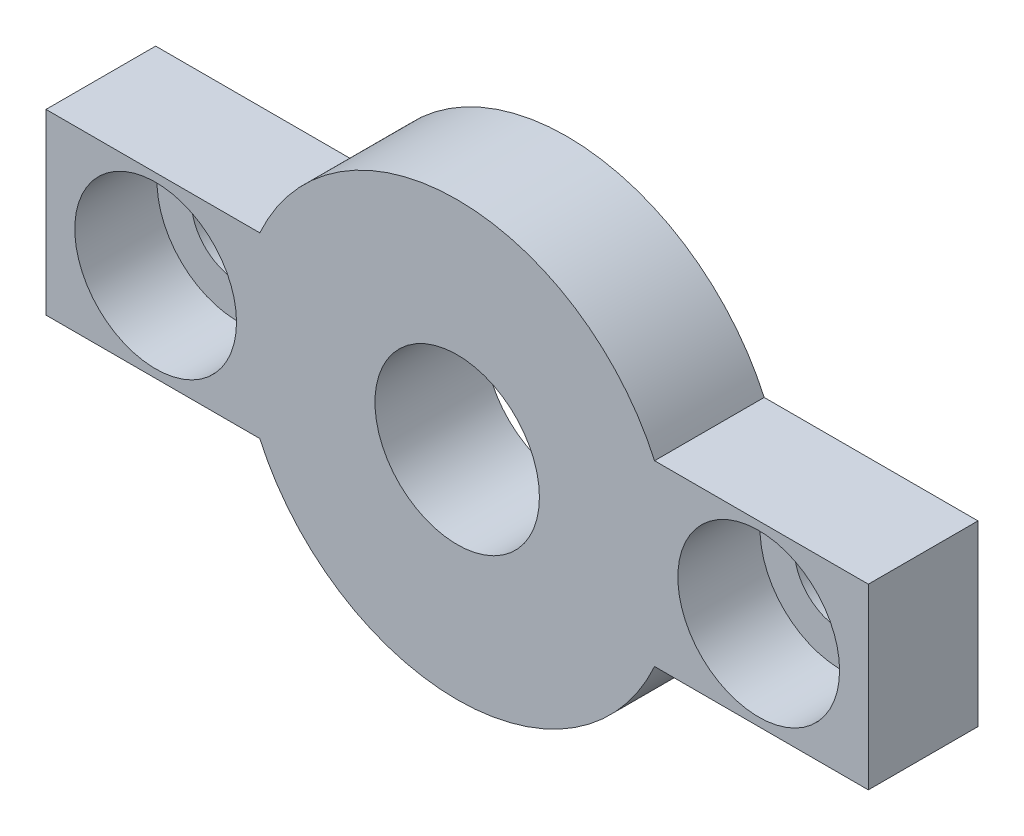
ISO-10303-21;
HEADER;
FILE_DESCRIPTION(('STEP AP214'),'2;1');
FILE_NAME('part.step','',(''),(''),'','','');
FILE_SCHEMA(('AUTOMOTIVE_DESIGN { 1 0 10303 214 1 1 1 1 }'));
ENDSEC;
DATA;
#1=APPLICATION_CONTEXT('core data for automotive mechanical design processes');
#2=APPLICATION_PROTOCOL_DEFINITION('international standard','automotive_design',2000,#1);
#3=PRODUCT_CONTEXT('',#1,'mechanical');
#4=PRODUCT('Part','Part','',(#3));
#5=PRODUCT_RELATED_PRODUCT_CATEGORY('part','',(#4));
#6=PRODUCT_DEFINITION_FORMATION('','',#4);
#7=PRODUCT_DEFINITION_CONTEXT('part definition',#1,'design');
#8=PRODUCT_DEFINITION('design','',#6,#7);
#9=PRODUCT_DEFINITION_SHAPE('','',#8);
#10=(LENGTH_UNIT() NAMED_UNIT(*) SI_UNIT(.MILLI.,.METRE.));
#11=(NAMED_UNIT(*) PLANE_ANGLE_UNIT() SI_UNIT($,.RADIAN.));
#12=(NAMED_UNIT(*) SI_UNIT($,.STERADIAN.) SOLID_ANGLE_UNIT());
#13=UNCERTAINTY_MEASURE_WITH_UNIT(LENGTH_MEASURE(1.E-05),#10,'distance_accuracy_value','');
#14=(GEOMETRIC_REPRESENTATION_CONTEXT(3) GLOBAL_UNCERTAINTY_ASSIGNED_CONTEXT((#13)) GLOBAL_UNIT_ASSIGNED_CONTEXT((#10,
#11,#12)) REPRESENTATION_CONTEXT('',''));
#15=CARTESIAN_POINT('',(0.,0.,0.));
#16=DIRECTION('',(0.,0.,1.));
#17=DIRECTION('',(1.,0.,0.));
#18=AXIS2_PLACEMENT_3D('',#15,#16,#17);
#19=CARTESIAN_POINT('',(11.,0.,0.));
#20=DIRECTION('',(0.,0.,1.));
#21=DIRECTION('',(1.,0.,0.));
#22=AXIS2_PLACEMENT_3D('',#19,#20,#21);
#23=CYLINDRICAL_SURFACE('',#22,1.7);
#24=CARTESIAN_POINT('',(11.,0.,0.));
#25=DIRECTION('',(0.,0.,1.));
#26=DIRECTION('',(1.,0.,0.));
#27=AXIS2_PLACEMENT_3D('',#24,#25,#26);
#28=CIRCLE('',#27,1.7);
#29=CARTESIAN_POINT('',(12.7,0.,0.));
#30=VERTEX_POINT('',#29);
#31=EDGE_CURVE('E193',#30,#30,#28,.T.);
#32=ORIENTED_EDGE('',*,*,#31,.F.);
#33=EDGE_LOOP('',(#32));
#34=FACE_BOUND('',#33,.T.);
#35=CARTESIAN_POINT('',(11.,0.,1.));
#36=DIRECTION('',(0.,0.,1.));
#37=DIRECTION('',(1.,0.,0.));
#38=AXIS2_PLACEMENT_3D('',#35,#36,#37);
#39=CIRCLE('',#38,1.7);
#40=CARTESIAN_POINT('',(12.7,0.,1.));
#41=VERTEX_POINT('',#40);
#42=EDGE_CURVE('E43',#41,#41,#39,.F.);
#43=ORIENTED_EDGE('',*,*,#42,.F.);
#44=EDGE_LOOP('',(#43));
#45=FACE_BOUND('',#44,.T.);
#46=ADVANCED_FACE('F39',(#34,#45),#23,.F.);
#47=CARTESIAN_POINT('',(-11.,0.,0.));
#48=DIRECTION('',(0.,0.,1.));
#49=DIRECTION('',(1.,0.,0.));
#50=AXIS2_PLACEMENT_3D('',#47,#48,#49);
#51=CYLINDRICAL_SURFACE('',#50,1.7);
#52=CARTESIAN_POINT('',(-11.,0.,0.));
#53=DIRECTION('',(0.,0.,1.));
#54=DIRECTION('',(1.,0.,0.));
#55=AXIS2_PLACEMENT_3D('',#52,#53,#54);
#56=CIRCLE('',#55,1.7);
#57=CARTESIAN_POINT('',(-9.3,0.,0.));
#58=VERTEX_POINT('',#57);
#59=EDGE_CURVE('E211',#58,#58,#56,.T.);
#60=ORIENTED_EDGE('',*,*,#59,.F.);
#61=EDGE_LOOP('',(#60));
#62=FACE_BOUND('',#61,.T.);
#63=CARTESIAN_POINT('',(-11.,0.,1.));
#64=DIRECTION('',(0.,0.,1.));
#65=DIRECTION('',(1.,0.,0.));
#66=AXIS2_PLACEMENT_3D('',#63,#64,#65);
#67=CIRCLE('',#66,1.7);
#68=CARTESIAN_POINT('',(-9.3,0.,1.));
#69=VERTEX_POINT('',#68);
#70=EDGE_CURVE('E184',#69,#69,#67,.F.);
#71=ORIENTED_EDGE('',*,*,#70,.F.);
#72=EDGE_LOOP('',(#71));
#73=FACE_BOUND('',#72,.T.);
#74=ADVANCED_FACE('F267',(#62,#73),#51,.F.);
#75=CARTESIAN_POINT('',(0.,0.,4.));
#76=DIRECTION('',(0.,0.,1.));
#77=DIRECTION('',(1.,0.,0.));
#78=AXIS2_PLACEMENT_3D('',#75,#76,#77);
#79=PLANE('',#78);
#80=CARTESIAN_POINT('',(-11.,0.,4.));
#81=DIRECTION('',(0.,0.,1.));
#82=DIRECTION('',(1.,0.,0.));
#83=AXIS2_PLACEMENT_3D('',#80,#81,#82);
#84=CIRCLE('',#83,2.95);
#85=CARTESIAN_POINT('',(-8.05,0.,4.));
#86=VERTEX_POINT('',#85);
#87=EDGE_CURVE('E195',#86,#86,#84,.T.);
#88=ORIENTED_EDGE('',*,*,#87,.F.);
#89=EDGE_LOOP('',(#88));
#90=FACE_BOUND('',#89,.T.);
#91=CARTESIAN_POINT('',(11.,0.,4.));
#92=DIRECTION('',(0.,0.,1.));
#93=DIRECTION('',(1.,0.,0.));
#94=AXIS2_PLACEMENT_3D('',#91,#92,#93);
#95=CIRCLE('',#94,2.95);
#96=CARTESIAN_POINT('',(13.95,0.,4.));
#97=VERTEX_POINT('',#96);
#98=EDGE_CURVE('E207',#97,#97,#95,.T.);
#99=ORIENTED_EDGE('',*,*,#98,.F.);
#100=EDGE_LOOP('',(#99));
#101=FACE_BOUND('',#100,.T.);
#102=DIRECTION('',(0.,-1.,0.));
#103=VECTOR('',#102,1.);
#104=CARTESIAN_POINT('',(-15.,-3.25,4.));
#105=LINE('',#104,#103);
#106=CARTESIAN_POINT('',(-15.,3.25,4.));
#107=VERTEX_POINT('',#106);
#108=CARTESIAN_POINT('',(-15.,-3.25,4.));
#109=VERTEX_POINT('',#108);
#110=EDGE_CURVE('E167',#107,#109,#105,.T.);
#111=ORIENTED_EDGE('',*,*,#110,.T.);
#112=DIRECTION('',(1.,0.,0.));
#113=VECTOR('',#112,1.);
#114=CARTESIAN_POINT('',(-7.20052081449669,-3.25,4.));
#115=LINE('',#114,#113);
#116=CARTESIAN_POINT('',(-7.20052081449669,-3.25,4.));
#117=VERTEX_POINT('',#116);
#118=EDGE_CURVE('E102',#109,#117,#115,.T.);
#119=ORIENTED_EDGE('',*,*,#118,.T.);
#120=CARTESIAN_POINT('',(0.,0.,4.));
#121=DIRECTION('',(0.,0.,1.));
#122=DIRECTION('',(1.,0.,0.));
#123=AXIS2_PLACEMENT_3D('',#120,#121,#122);
#124=CIRCLE('',#123,7.9);
#125=CARTESIAN_POINT('',(7.20052081449669,-3.25,4.));
#126=VERTEX_POINT('',#125);
#127=EDGE_CURVE('E229',#117,#126,#124,.T.);
#128=ORIENTED_EDGE('',*,*,#127,.T.);
#129=DIRECTION('',(1.,0.,0.));
#130=VECTOR('',#129,1.);
#131=CARTESIAN_POINT('',(15.,-3.25,4.));
#132=LINE('',#131,#130);
#133=CARTESIAN_POINT('',(15.,-3.25,4.));
#134=VERTEX_POINT('',#133);
#135=EDGE_CURVE('E232',#126,#134,#132,.T.);
#136=ORIENTED_EDGE('',*,*,#135,.T.);
#137=DIRECTION('',(0.,1.,0.));
#138=VECTOR('',#137,1.);
#139=CARTESIAN_POINT('',(15.,-3.25,4.));
#140=LINE('',#139,#138);
#141=CARTESIAN_POINT('',(15.,3.25,4.));
#142=VERTEX_POINT('',#141);
#143=EDGE_CURVE('E122',#134,#142,#140,.T.);
#144=ORIENTED_EDGE('',*,*,#143,.T.);
#145=DIRECTION('',(-1.,0.,0.));
#146=VECTOR('',#145,1.);
#147=CARTESIAN_POINT('',(15.,3.25,4.));
#148=LINE('',#147,#146);
#149=CARTESIAN_POINT('',(7.20052081449669,3.25,4.));
#150=VERTEX_POINT('',#149);
#151=EDGE_CURVE('E115',#142,#150,#148,.T.);
#152=ORIENTED_EDGE('',*,*,#151,.T.);
#153=CARTESIAN_POINT('',(0.,0.,4.));
#154=DIRECTION('',(0.,0.,1.));
#155=DIRECTION('',(1.,0.,0.));
#156=AXIS2_PLACEMENT_3D('',#153,#154,#155);
#157=CIRCLE('',#156,7.9);
#158=CARTESIAN_POINT('',(-7.20052081449669,3.25,4.));
#159=VERTEX_POINT('',#158);
#160=EDGE_CURVE('E120',#150,#159,#157,.T.);
#161=ORIENTED_EDGE('',*,*,#160,.T.);
#162=DIRECTION('',(-1.,0.,0.));
#163=VECTOR('',#162,1.);
#164=CARTESIAN_POINT('',(-7.20052081449669,3.25,4.));
#165=LINE('',#164,#163);
#166=EDGE_CURVE('E59',#159,#107,#165,.T.);
#167=ORIENTED_EDGE('',*,*,#166,.T.);
#168=EDGE_LOOP('',(#111,#119,#128,#136,#144,#152,#161,#167));
#169=FACE_BOUND('',#168,.T.);
#170=CARTESIAN_POINT('',(0.,0.,4.));
#171=DIRECTION('',(0.,0.,1.));
#172=DIRECTION('',(1.,0.,0.));
#173=AXIS2_PLACEMENT_3D('',#170,#171,#172);
#174=CIRCLE('',#173,3.);
#175=CARTESIAN_POINT('',(3.,0.,4.));
#176=VERTEX_POINT('',#175);
#177=EDGE_CURVE('E149',#176,#176,#174,.T.);
#178=ORIENTED_EDGE('',*,*,#177,.F.);
#179=EDGE_LOOP('',(#178));
#180=FACE_BOUND('',#179,.T.);
#181=ADVANCED_FACE('F117',(#90,#101,#169,#180),#79,.T.);
#182=CARTESIAN_POINT('',(0.,0.,0.));
#183=DIRECTION('',(0.,0.,1.));
#184=DIRECTION('',(1.,0.,0.));
#185=AXIS2_PLACEMENT_3D('',#182,#183,#184);
#186=PLANE('',#185);
#187=ORIENTED_EDGE('',*,*,#59,.T.);
#188=EDGE_LOOP('',(#187));
#189=FACE_BOUND('',#188,.T.);
#190=ORIENTED_EDGE('',*,*,#31,.T.);
#191=EDGE_LOOP('',(#190));
#192=FACE_BOUND('',#191,.T.);
#193=DIRECTION('',(0.,-1.,0.));
#194=VECTOR('',#193,1.);
#195=CARTESIAN_POINT('',(-15.,-3.25,0.));
#196=LINE('',#195,#194);
#197=CARTESIAN_POINT('',(-15.,3.25,0.));
#198=VERTEX_POINT('',#197);
#199=CARTESIAN_POINT('',(-15.,-3.25,0.));
#200=VERTEX_POINT('',#199);
#201=EDGE_CURVE('E144',#198,#200,#196,.T.);
#202=ORIENTED_EDGE('',*,*,#201,.F.);
#203=DIRECTION('',(-1.,0.,0.));
#204=VECTOR('',#203,1.);
#205=CARTESIAN_POINT('',(-7.20052081449669,3.25,0.));
#206=LINE('',#205,#204);
#207=CARTESIAN_POINT('',(-7.20052081449669,3.25,0.));
#208=VERTEX_POINT('',#207);
#209=EDGE_CURVE('E94',#208,#198,#206,.T.);
#210=ORIENTED_EDGE('',*,*,#209,.F.);
#211=CARTESIAN_POINT('',(0.,0.,0.));
#212=DIRECTION('',(0.,0.,1.));
#213=DIRECTION('',(1.,0.,0.));
#214=AXIS2_PLACEMENT_3D('',#211,#212,#213);
#215=CIRCLE('',#214,7.9);
#216=CARTESIAN_POINT('',(7.20052081449669,3.25,0.));
#217=VERTEX_POINT('',#216);
#218=EDGE_CURVE('E88',#217,#208,#215,.T.);
#219=ORIENTED_EDGE('',*,*,#218,.F.);
#220=DIRECTION('',(-1.,0.,0.));
#221=VECTOR('',#220,1.);
#222=CARTESIAN_POINT('',(15.,3.25,0.));
#223=LINE('',#222,#221);
#224=CARTESIAN_POINT('',(15.,3.25,0.));
#225=VERTEX_POINT('',#224);
#226=EDGE_CURVE('E131',#225,#217,#223,.T.);
#227=ORIENTED_EDGE('',*,*,#226,.F.);
#228=DIRECTION('',(0.,1.,0.));
#229=VECTOR('',#228,1.);
#230=CARTESIAN_POINT('',(15.,-3.25,0.));
#231=LINE('',#230,#229);
#232=CARTESIAN_POINT('',(15.,-3.25,0.));
#233=VERTEX_POINT('',#232);
#234=EDGE_CURVE('E158',#233,#225,#231,.T.);
#235=ORIENTED_EDGE('',*,*,#234,.F.);
#236=DIRECTION('',(1.,0.,0.));
#237=VECTOR('',#236,1.);
#238=CARTESIAN_POINT('',(15.,-3.25,0.));
#239=LINE('',#238,#237);
#240=CARTESIAN_POINT('',(7.20052081449669,-3.25,0.));
#241=VERTEX_POINT('',#240);
#242=EDGE_CURVE('E155',#241,#233,#239,.T.);
#243=ORIENTED_EDGE('',*,*,#242,.F.);
#244=CARTESIAN_POINT('',(0.,0.,0.));
#245=DIRECTION('',(0.,0.,1.));
#246=DIRECTION('',(1.,0.,0.));
#247=AXIS2_PLACEMENT_3D('',#244,#245,#246);
#248=CIRCLE('',#247,7.9);
#249=CARTESIAN_POINT('',(-7.20052081449669,-3.25,0.));
#250=VERTEX_POINT('',#249);
#251=EDGE_CURVE('E152',#250,#241,#248,.T.);
#252=ORIENTED_EDGE('',*,*,#251,.F.);
#253=DIRECTION('',(1.,0.,0.));
#254=VECTOR('',#253,1.);
#255=CARTESIAN_POINT('',(-7.20052081449669,-3.25,0.));
#256=LINE('',#255,#254);
#257=EDGE_CURVE('E148',#200,#250,#256,.T.);
#258=ORIENTED_EDGE('',*,*,#257,.F.);
#259=EDGE_LOOP('',(#202,#210,#219,#227,#235,#243,#252,#258));
#260=FACE_BOUND('',#259,.T.);
#261=CARTESIAN_POINT('',(0.,0.,0.));
#262=DIRECTION('',(0.,0.,1.));
#263=DIRECTION('',(1.,0.,0.));
#264=AXIS2_PLACEMENT_3D('',#261,#262,#263);
#265=CIRCLE('',#264,3.);
#266=CARTESIAN_POINT('',(3.,0.,0.));
#267=VERTEX_POINT('',#266);
#268=EDGE_CURVE('E215',#267,#267,#265,.T.);
#269=ORIENTED_EDGE('',*,*,#268,.T.);
#270=EDGE_LOOP('',(#269));
#271=FACE_BOUND('',#270,.T.);
#272=ADVANCED_FACE('F247',(#189,#192,#260,#271),#186,.F.);
#273=CARTESIAN_POINT('',(-15.,-3.25,4.));
#274=DIRECTION('',(1.,0.,0.));
#275=DIRECTION('',(0.,0.,-1.));
#276=AXIS2_PLACEMENT_3D('',#273,#274,#275);
#277=PLANE('',#276);
#278=ORIENTED_EDGE('',*,*,#201,.T.);
#279=DIRECTION('',(0.,0.,-1.));
#280=VECTOR('',#279,1.);
#281=CARTESIAN_POINT('',(-15.,-3.25,4.));
#282=LINE('',#281,#280);
#283=EDGE_CURVE('E11',#109,#200,#282,.T.);
#284=ORIENTED_EDGE('',*,*,#283,.F.);
#285=ORIENTED_EDGE('',*,*,#110,.F.);
#286=DIRECTION('',(0.,0.,-1.));
#287=VECTOR('',#286,1.);
#288=CARTESIAN_POINT('',(-15.,3.25,4.));
#289=LINE('',#288,#287);
#290=EDGE_CURVE('E140',#107,#198,#289,.T.);
#291=ORIENTED_EDGE('',*,*,#290,.T.);
#292=EDGE_LOOP('',(#278,#284,#285,#291));
#293=FACE_BOUND('',#292,.T.);
#294=ADVANCED_FACE('F41',(#293),#277,.F.);
#295=CARTESIAN_POINT('',(-7.20052081449669,-3.25,4.));
#296=DIRECTION('',(0.,1.,0.));
#297=DIRECTION('',(-1.,0.,0.));
#298=AXIS2_PLACEMENT_3D('',#295,#296,#297);
#299=PLANE('',#298);
#300=ORIENTED_EDGE('',*,*,#257,.T.);
#301=DIRECTION('',(0.,0.,-1.));
#302=VECTOR('',#301,1.);
#303=CARTESIAN_POINT('',(-7.20052081449669,-3.25,4.));
#304=LINE('',#303,#302);
#305=EDGE_CURVE('E50',#117,#250,#304,.T.);
#306=ORIENTED_EDGE('',*,*,#305,.F.);
#307=ORIENTED_EDGE('',*,*,#118,.F.);
#308=ORIENTED_EDGE('',*,*,#283,.T.);
#309=EDGE_LOOP('',(#300,#306,#307,#308));
#310=FACE_BOUND('',#309,.T.);
#311=ADVANCED_FACE('F286',(#310),#299,.F.);
#312=CARTESIAN_POINT('',(0.,0.,4.));
#313=DIRECTION('',(0.,0.,-1.));
#314=DIRECTION('',(-1.,0.,0.));
#315=AXIS2_PLACEMENT_3D('',#312,#313,#314);
#316=CYLINDRICAL_SURFACE('',#315,7.9);
#317=ORIENTED_EDGE('',*,*,#251,.T.);
#318=DIRECTION('',(0.,0.,-1.));
#319=VECTOR('',#318,1.);
#320=CARTESIAN_POINT('',(7.20052081449669,-3.25,4.));
#321=LINE('',#320,#319);
#322=EDGE_CURVE('E178',#126,#241,#321,.T.);
#323=ORIENTED_EDGE('',*,*,#322,.F.);
#324=ORIENTED_EDGE('',*,*,#127,.F.);
#325=ORIENTED_EDGE('',*,*,#305,.T.);
#326=EDGE_LOOP('',(#317,#323,#324,#325));
#327=FACE_BOUND('',#326,.T.);
#328=ADVANCED_FACE('F293',(#327),#316,.T.);
#329=CARTESIAN_POINT('',(15.,-3.25,4.));
#330=DIRECTION('',(0.,1.,0.));
#331=DIRECTION('',(-1.,0.,0.));
#332=AXIS2_PLACEMENT_3D('',#329,#330,#331);
#333=PLANE('',#332);
#334=ORIENTED_EDGE('',*,*,#242,.T.);
#335=DIRECTION('',(0.,0.,-1.));
#336=VECTOR('',#335,1.);
#337=CARTESIAN_POINT('',(15.,-3.25,4.));
#338=LINE('',#337,#336);
#339=EDGE_CURVE('E174',#134,#233,#338,.T.);
#340=ORIENTED_EDGE('',*,*,#339,.F.);
#341=ORIENTED_EDGE('',*,*,#135,.F.);
#342=ORIENTED_EDGE('',*,*,#322,.T.);
#343=EDGE_LOOP('',(#334,#340,#341,#342));
#344=FACE_BOUND('',#343,.T.);
#345=ADVANCED_FACE('F240',(#344),#333,.F.);
#346=CARTESIAN_POINT('',(15.,-3.25,4.));
#347=DIRECTION('',(-1.,0.,0.));
#348=DIRECTION('',(0.,-1.,0.));
#349=AXIS2_PLACEMENT_3D('',#346,#347,#348);
#350=PLANE('',#349);
#351=ORIENTED_EDGE('',*,*,#234,.T.);
#352=DIRECTION('',(0.,0.,-1.));
#353=VECTOR('',#352,1.);
#354=CARTESIAN_POINT('',(15.,3.25,4.));
#355=LINE('',#354,#353);
#356=EDGE_CURVE('E133',#142,#225,#355,.T.);
#357=ORIENTED_EDGE('',*,*,#356,.F.);
#358=ORIENTED_EDGE('',*,*,#143,.F.);
#359=ORIENTED_EDGE('',*,*,#339,.T.);
#360=EDGE_LOOP('',(#351,#357,#358,#359));
#361=FACE_BOUND('',#360,.T.);
#362=ADVANCED_FACE('F244',(#361),#350,.F.);
#363=CARTESIAN_POINT('',(15.,3.25,4.));
#364=DIRECTION('',(0.,-1.,0.));
#365=DIRECTION('',(1.,0.,0.));
#366=AXIS2_PLACEMENT_3D('',#363,#364,#365);
#367=PLANE('',#366);
#368=ORIENTED_EDGE('',*,*,#226,.T.);
#369=DIRECTION('',(0.,0.,-1.));
#370=VECTOR('',#369,1.);
#371=CARTESIAN_POINT('',(7.20052081449669,3.25,4.));
#372=LINE('',#371,#370);
#373=EDGE_CURVE('E128',#150,#217,#372,.T.);
#374=ORIENTED_EDGE('',*,*,#373,.F.);
#375=ORIENTED_EDGE('',*,*,#151,.F.);
#376=ORIENTED_EDGE('',*,*,#356,.T.);
#377=EDGE_LOOP('',(#368,#374,#375,#376));
#378=FACE_BOUND('',#377,.T.);
#379=ADVANCED_FACE('F129',(#378),#367,.F.);
#380=CARTESIAN_POINT('',(0.,0.,4.));
#381=DIRECTION('',(0.,0.,-1.));
#382=DIRECTION('',(-1.,0.,0.));
#383=AXIS2_PLACEMENT_3D('',#380,#381,#382);
#384=CYLINDRICAL_SURFACE('',#383,7.9);
#385=ORIENTED_EDGE('',*,*,#218,.T.);
#386=DIRECTION('',(0.,0.,-1.));
#387=VECTOR('',#386,1.);
#388=CARTESIAN_POINT('',(-7.20052081449669,3.25,4.));
#389=LINE('',#388,#387);
#390=EDGE_CURVE('E134',#159,#208,#389,.T.);
#391=ORIENTED_EDGE('',*,*,#390,.F.);
#392=ORIENTED_EDGE('',*,*,#160,.F.);
#393=ORIENTED_EDGE('',*,*,#373,.T.);
#394=EDGE_LOOP('',(#385,#391,#392,#393));
#395=FACE_BOUND('',#394,.T.);
#396=ADVANCED_FACE('F136',(#395),#384,.T.);
#397=CARTESIAN_POINT('',(-7.20052081449669,3.25,4.));
#398=DIRECTION('',(0.,-1.,0.));
#399=DIRECTION('',(1.,0.,0.));
#400=AXIS2_PLACEMENT_3D('',#397,#398,#399);
#401=PLANE('',#400);
#402=ORIENTED_EDGE('',*,*,#209,.T.);
#403=ORIENTED_EDGE('',*,*,#290,.F.);
#404=ORIENTED_EDGE('',*,*,#166,.F.);
#405=ORIENTED_EDGE('',*,*,#390,.T.);
#406=EDGE_LOOP('',(#402,#403,#404,#405));
#407=FACE_BOUND('',#406,.T.);
#408=ADVANCED_FACE('F253',(#407),#401,.F.);
#409=CARTESIAN_POINT('',(0.,0.,4.));
#410=DIRECTION('',(0.,0.,-1.));
#411=DIRECTION('',(-1.,0.,0.));
#412=AXIS2_PLACEMENT_3D('',#409,#410,#411);
#413=CYLINDRICAL_SURFACE('',#412,3.);
#414=ORIENTED_EDGE('',*,*,#177,.T.);
#415=EDGE_LOOP('',(#414));
#416=FACE_BOUND('',#415,.T.);
#417=ORIENTED_EDGE('',*,*,#268,.F.);
#418=EDGE_LOOP('',(#417));
#419=FACE_BOUND('',#418,.T.);
#420=ADVANCED_FACE('F255',(#416,#419),#413,.F.);
#421=CARTESIAN_POINT('',(-11.,0.,1.));
#422=DIRECTION('',(0.,0.,1.));
#423=DIRECTION('',(1.,0.,0.));
#424=AXIS2_PLACEMENT_3D('',#421,#422,#423);
#425=PLANE('',#424);
#426=CARTESIAN_POINT('',(-11.,0.,1.));
#427=DIRECTION('',(0.,0.,1.));
#428=DIRECTION('',(1.,0.,0.));
#429=AXIS2_PLACEMENT_3D('',#426,#427,#428);
#430=CIRCLE('',#429,2.95);
#431=CARTESIAN_POINT('',(-8.05,0.,1.));
#432=VERTEX_POINT('',#431);
#433=EDGE_CURVE('E187',#432,#432,#430,.T.);
#434=ORIENTED_EDGE('',*,*,#433,.T.);
#435=EDGE_LOOP('',(#434));
#436=FACE_BOUND('',#435,.T.);
#437=ORIENTED_EDGE('',*,*,#70,.T.);
#438=EDGE_LOOP('',(#437));
#439=FACE_BOUND('',#438,.T.);
#440=ADVANCED_FACE('F261',(#436,#439),#425,.T.);
#441=CARTESIAN_POINT('',(-11.,0.,1.));
#442=DIRECTION('',(0.,0.,1.));
#443=DIRECTION('',(1.,0.,0.));
#444=AXIS2_PLACEMENT_3D('',#441,#442,#443);
#445=CYLINDRICAL_SURFACE('',#444,2.95);
#446=ORIENTED_EDGE('',*,*,#433,.F.);
#447=EDGE_LOOP('',(#446));
#448=FACE_BOUND('',#447,.T.);
#449=ORIENTED_EDGE('',*,*,#87,.T.);
#450=EDGE_LOOP('',(#449));
#451=FACE_BOUND('',#450,.T.);
#452=ADVANCED_FACE('F353',(#448,#451),#445,.F.);
#453=CARTESIAN_POINT('',(11.,0.,1.));
#454=DIRECTION('',(0.,0.,1.));
#455=DIRECTION('',(1.,0.,0.));
#456=AXIS2_PLACEMENT_3D('',#453,#454,#455);
#457=PLANE('',#456);
#458=CARTESIAN_POINT('',(11.,0.,1.));
#459=DIRECTION('',(0.,0.,1.));
#460=DIRECTION('',(1.,0.,0.));
#461=AXIS2_PLACEMENT_3D('',#458,#459,#460);
#462=CIRCLE('',#461,2.95);
#463=CARTESIAN_POINT('',(13.95,0.,1.));
#464=VERTEX_POINT('',#463);
#465=EDGE_CURVE('E201',#464,#464,#462,.T.);
#466=ORIENTED_EDGE('',*,*,#465,.T.);
#467=EDGE_LOOP('',(#466));
#468=FACE_BOUND('',#467,.T.);
#469=ORIENTED_EDGE('',*,*,#42,.T.);
#470=EDGE_LOOP('',(#469));
#471=FACE_BOUND('',#470,.T.);
#472=ADVANCED_FACE('F362',(#468,#471),#457,.T.);
#473=CARTESIAN_POINT('',(11.,0.,1.));
#474=DIRECTION('',(0.,0.,1.));
#475=DIRECTION('',(1.,0.,0.));
#476=AXIS2_PLACEMENT_3D('',#473,#474,#475);
#477=CYLINDRICAL_SURFACE('',#476,2.95);
#478=ORIENTED_EDGE('',*,*,#465,.F.);
#479=EDGE_LOOP('',(#478));
#480=FACE_BOUND('',#479,.T.);
#481=ORIENTED_EDGE('',*,*,#98,.T.);
#482=EDGE_LOOP('',(#481));
#483=FACE_BOUND('',#482,.T.);
#484=ADVANCED_FACE('F372',(#480,#483),#477,.F.);
#485=CLOSED_SHELL('',(#46,#74,#181,#272,#294,#311,#328,#345,#362,#379,#396,#408,#420,#440,#452,
#472,#484));
#486=MANIFOLD_SOLID_BREP('B2',#485);
#487=ADVANCED_BREP_SHAPE_REPRESENTATION('',(#18,#486),#14);
#488=SHAPE_DEFINITION_REPRESENTATION(#9,#487);
ENDSEC;
END-ISO-10303-21;
